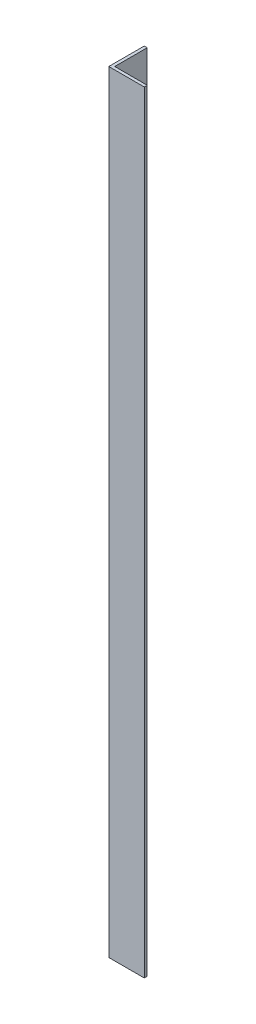
ISO-10303-21;
HEADER;
FILE_DESCRIPTION(('STEP AP214'),'2;1');
FILE_NAME('part.step','',(''),(''),'','','');
FILE_SCHEMA(('AUTOMOTIVE_DESIGN { 1 0 10303 214 1 1 1 1 }'));
ENDSEC;
DATA;
#1=APPLICATION_CONTEXT('core data for automotive mechanical design processes');
#2=APPLICATION_PROTOCOL_DEFINITION('international standard','automotive_design',2000,#1);
#3=PRODUCT_CONTEXT('',#1,'mechanical');
#4=PRODUCT('Part','Part','',(#3));
#5=PRODUCT_RELATED_PRODUCT_CATEGORY('part','',(#4));
#6=PRODUCT_DEFINITION_FORMATION('','',#4);
#7=PRODUCT_DEFINITION_CONTEXT('part definition',#1,'design');
#8=PRODUCT_DEFINITION('design','',#6,#7);
#9=PRODUCT_DEFINITION_SHAPE('','',#8);
#10=(LENGTH_UNIT() NAMED_UNIT(*) SI_UNIT(.MILLI.,.METRE.));
#11=(NAMED_UNIT(*) PLANE_ANGLE_UNIT() SI_UNIT($,.RADIAN.));
#12=(NAMED_UNIT(*) SI_UNIT($,.STERADIAN.) SOLID_ANGLE_UNIT());
#13=UNCERTAINTY_MEASURE_WITH_UNIT(LENGTH_MEASURE(1.E-05),#10,'distance_accuracy_value','');
#14=(GEOMETRIC_REPRESENTATION_CONTEXT(3) GLOBAL_UNCERTAINTY_ASSIGNED_CONTEXT((#13)) GLOBAL_UNIT_ASSIGNED_CONTEXT((#10,
#11,#12)) REPRESENTATION_CONTEXT('',''));
#15=CARTESIAN_POINT('',(0.,0.,0.));
#16=DIRECTION('',(0.,0.,1.));
#17=DIRECTION('',(1.,0.,0.));
#18=AXIS2_PLACEMENT_3D('',#15,#16,#17);
#19=CARTESIAN_POINT('',(0.,414.3375,0.));
#20=DIRECTION('',(1.,0.,0.));
#21=DIRECTION('',(0.,0.,-1.));
#22=AXIS2_PLACEMENT_3D('',#19,#20,#21);
#23=PLANE('',#22);
#24=DIRECTION('',(0.,0.,1.));
#25=VECTOR('',#24,1.);
#26=CARTESIAN_POINT('',(0.,0.,0.));
#27=LINE('',#26,#25);
#28=CARTESIAN_POINT('',(0.,0.,-19.05));
#29=VERTEX_POINT('',#28);
#30=CARTESIAN_POINT('',(0.,0.,0.));
#31=VERTEX_POINT('',#30);
#32=EDGE_CURVE('E123',#29,#31,#27,.T.);
#33=ORIENTED_EDGE('',*,*,#32,.T.);
#34=DIRECTION('',(0.,-1.,0.));
#35=VECTOR('',#34,1.);
#36=CARTESIAN_POINT('',(0.,414.3375,0.));
#37=LINE('',#36,#35);
#38=CARTESIAN_POINT('',(0.,414.3375,0.));
#39=VERTEX_POINT('',#38);
#40=EDGE_CURVE('E11',#39,#31,#37,.T.);
#41=ORIENTED_EDGE('',*,*,#40,.F.);
#42=DIRECTION('',(0.,0.,1.));
#43=VECTOR('',#42,1.);
#44=CARTESIAN_POINT('',(0.,414.3375,0.));
#45=LINE('',#44,#43);
#46=CARTESIAN_POINT('',(0.,414.3375,-19.05));
#47=VERTEX_POINT('',#46);
#48=EDGE_CURVE('E133',#47,#39,#45,.T.);
#49=ORIENTED_EDGE('',*,*,#48,.F.);
#50=DIRECTION('',(0.,-1.,0.));
#51=VECTOR('',#50,1.);
#52=CARTESIAN_POINT('',(0.,414.3375,-19.05));
#53=LINE('',#52,#51);
#54=EDGE_CURVE('E119',#47,#29,#53,.T.);
#55=ORIENTED_EDGE('',*,*,#54,.T.);
#56=EDGE_LOOP('',(#33,#41,#49,#55));
#57=FACE_BOUND('',#56,.T.);
#58=ADVANCED_FACE('F37',(#57),#23,.F.);
#59=CARTESIAN_POINT('',(0.,414.3375,0.));
#60=DIRECTION('',(0.,0.,-1.));
#61=DIRECTION('',(-1.,0.,0.));
#62=AXIS2_PLACEMENT_3D('',#59,#60,#61);
#63=PLANE('',#62);
#64=DIRECTION('',(1.,0.,0.));
#65=VECTOR('',#64,1.);
#66=CARTESIAN_POINT('',(0.,0.,0.));
#67=LINE('',#66,#65);
#68=CARTESIAN_POINT('',(19.05,0.,0.));
#69=VERTEX_POINT('',#68);
#70=EDGE_CURVE('E126',#31,#69,#67,.T.);
#71=ORIENTED_EDGE('',*,*,#70,.T.);
#72=DIRECTION('',(0.,-1.,0.));
#73=VECTOR('',#72,1.);
#74=CARTESIAN_POINT('',(19.05,414.3375,0.));
#75=LINE('',#74,#73);
#76=CARTESIAN_POINT('',(19.05,414.3375,0.));
#77=VERTEX_POINT('',#76);
#78=EDGE_CURVE('E46',#77,#69,#75,.T.);
#79=ORIENTED_EDGE('',*,*,#78,.F.);
#80=DIRECTION('',(1.,0.,0.));
#81=VECTOR('',#80,1.);
#82=CARTESIAN_POINT('',(0.,414.3375,0.));
#83=LINE('',#82,#81);
#84=EDGE_CURVE('E91',#39,#77,#83,.T.);
#85=ORIENTED_EDGE('',*,*,#84,.F.);
#86=ORIENTED_EDGE('',*,*,#40,.T.);
#87=EDGE_LOOP('',(#71,#79,#85,#86));
#88=FACE_BOUND('',#87,.T.);
#89=ADVANCED_FACE('F157',(#88),#63,.F.);
#90=CARTESIAN_POINT('',(19.05,414.3375,-1.5875));
#91=DIRECTION('',(-1.,0.,0.));
#92=DIRECTION('',(0.,0.,1.));
#93=AXIS2_PLACEMENT_3D('',#90,#91,#92);
#94=PLANE('',#93);
#95=DIRECTION('',(0.,0.,-1.));
#96=VECTOR('',#95,1.);
#97=CARTESIAN_POINT('',(19.05,0.,-1.5875));
#98=LINE('',#97,#96);
#99=CARTESIAN_POINT('',(19.05,0.,-1.5875));
#100=VERTEX_POINT('',#99);
#101=EDGE_CURVE('E128',#69,#100,#98,.T.);
#102=ORIENTED_EDGE('',*,*,#101,.T.);
#103=DIRECTION('',(0.,-1.,0.));
#104=VECTOR('',#103,1.);
#105=CARTESIAN_POINT('',(19.05,414.3375,-1.5875));
#106=LINE('',#105,#104);
#107=CARTESIAN_POINT('',(19.05,414.3375,-1.5875));
#108=VERTEX_POINT('',#107);
#109=EDGE_CURVE('E114',#108,#100,#106,.T.);
#110=ORIENTED_EDGE('',*,*,#109,.F.);
#111=DIRECTION('',(0.,0.,-1.));
#112=VECTOR('',#111,1.);
#113=CARTESIAN_POINT('',(19.05,414.3375,-1.5875));
#114=LINE('',#113,#112);
#115=EDGE_CURVE('E104',#77,#108,#114,.T.);
#116=ORIENTED_EDGE('',*,*,#115,.F.);
#117=ORIENTED_EDGE('',*,*,#78,.T.);
#118=EDGE_LOOP('',(#102,#110,#116,#117));
#119=FACE_BOUND('',#118,.T.);
#120=ADVANCED_FACE('F139',(#119),#94,.F.);
#121=CARTESIAN_POINT('',(1.5875,414.3375,-1.5875));
#122=DIRECTION('',(0.,0.,1.));
#123=DIRECTION('',(1.,0.,0.));
#124=AXIS2_PLACEMENT_3D('',#121,#122,#123);
#125=PLANE('',#124);
#126=DIRECTION('',(-1.,0.,0.));
#127=VECTOR('',#126,1.);
#128=CARTESIAN_POINT('',(1.5875,0.,-1.5875));
#129=LINE('',#128,#127);
#130=CARTESIAN_POINT('',(1.5875,0.,-1.5875));
#131=VERTEX_POINT('',#130);
#132=EDGE_CURVE('E112',#100,#131,#129,.T.);
#133=ORIENTED_EDGE('',*,*,#132,.T.);
#134=DIRECTION('',(0.,-1.,0.));
#135=VECTOR('',#134,1.);
#136=CARTESIAN_POINT('',(1.5875,414.3375,-1.5875));
#137=LINE('',#136,#135);
#138=CARTESIAN_POINT('',(1.5875,414.3375,-1.5875));
#139=VERTEX_POINT('',#138);
#140=EDGE_CURVE('E109',#139,#131,#137,.T.);
#141=ORIENTED_EDGE('',*,*,#140,.F.);
#142=DIRECTION('',(-1.,0.,0.));
#143=VECTOR('',#142,1.);
#144=CARTESIAN_POINT('',(1.5875,414.3375,-1.5875));
#145=LINE('',#144,#143);
#146=EDGE_CURVE('E98',#108,#139,#145,.T.);
#147=ORIENTED_EDGE('',*,*,#146,.F.);
#148=ORIENTED_EDGE('',*,*,#109,.T.);
#149=EDGE_LOOP('',(#133,#141,#147,#148));
#150=FACE_BOUND('',#149,.T.);
#151=ADVANCED_FACE('F110',(#150),#125,.F.);
#152=CARTESIAN_POINT('',(1.5875,414.3375,-1.5875));
#153=DIRECTION('',(-1.,0.,0.));
#154=DIRECTION('',(0.,0.,1.));
#155=AXIS2_PLACEMENT_3D('',#152,#153,#154);
#156=PLANE('',#155);
#157=DIRECTION('',(0.,0.,-1.));
#158=VECTOR('',#157,1.);
#159=CARTESIAN_POINT('',(1.5875,0.,-1.5875));
#160=LINE('',#159,#158);
#161=CARTESIAN_POINT('',(1.5875,0.,-19.05));
#162=VERTEX_POINT('',#161);
#163=EDGE_CURVE('E77',#131,#162,#160,.T.);
#164=ORIENTED_EDGE('',*,*,#163,.T.);
#165=DIRECTION('',(0.,-1.,0.));
#166=VECTOR('',#165,1.);
#167=CARTESIAN_POINT('',(1.5875,414.3375,-19.05));
#168=LINE('',#167,#166);
#169=CARTESIAN_POINT('',(1.5875,414.3375,-19.05));
#170=VERTEX_POINT('',#169);
#171=EDGE_CURVE('E115',#170,#162,#168,.T.);
#172=ORIENTED_EDGE('',*,*,#171,.F.);
#173=DIRECTION('',(0.,0.,-1.));
#174=VECTOR('',#173,1.);
#175=CARTESIAN_POINT('',(1.5875,414.3375,-1.5875));
#176=LINE('',#175,#174);
#177=EDGE_CURVE('E102',#139,#170,#176,.T.);
#178=ORIENTED_EDGE('',*,*,#177,.F.);
#179=ORIENTED_EDGE('',*,*,#140,.T.);
#180=EDGE_LOOP('',(#164,#172,#178,#179));
#181=FACE_BOUND('',#180,.T.);
#182=ADVANCED_FACE('F117',(#181),#156,.F.);
#183=CARTESIAN_POINT('',(0.,414.3375,-19.05));
#184=DIRECTION('',(0.,0.,1.));
#185=DIRECTION('',(1.,0.,0.));
#186=AXIS2_PLACEMENT_3D('',#183,#184,#185);
#187=PLANE('',#186);
#188=DIRECTION('',(-1.,0.,0.));
#189=VECTOR('',#188,1.);
#190=CARTESIAN_POINT('',(0.,0.,-19.05));
#191=LINE('',#190,#189);
#192=EDGE_CURVE('E83',#162,#29,#191,.T.);
#193=ORIENTED_EDGE('',*,*,#192,.T.);
#194=ORIENTED_EDGE('',*,*,#54,.F.);
#195=DIRECTION('',(-1.,0.,0.));
#196=VECTOR('',#195,1.);
#197=CARTESIAN_POINT('',(0.,414.3375,-19.05));
#198=LINE('',#197,#196);
#199=EDGE_CURVE('E54',#170,#47,#198,.T.);
#200=ORIENTED_EDGE('',*,*,#199,.F.);
#201=ORIENTED_EDGE('',*,*,#171,.T.);
#202=EDGE_LOOP('',(#193,#194,#200,#201));
#203=FACE_BOUND('',#202,.T.);
#204=ADVANCED_FACE('F146',(#203),#187,.F.);
#205=CARTESIAN_POINT('',(0.,414.3375,0.));
#206=DIRECTION('',(0.,-1.,0.));
#207=DIRECTION('',(0.,0.,-1.));
#208=AXIS2_PLACEMENT_3D('',#205,#206,#207);
#209=PLANE('',#208);
#210=ORIENTED_EDGE('',*,*,#48,.T.);
#211=ORIENTED_EDGE('',*,*,#84,.T.);
#212=ORIENTED_EDGE('',*,*,#115,.T.);
#213=ORIENTED_EDGE('',*,*,#146,.T.);
#214=ORIENTED_EDGE('',*,*,#177,.T.);
#215=ORIENTED_EDGE('',*,*,#199,.T.);
#216=EDGE_LOOP('',(#210,#211,#212,#213,#214,#215));
#217=FACE_BOUND('',#216,.T.);
#218=ADVANCED_FACE('F100',(#217),#209,.F.);
#219=CARTESIAN_POINT('',(0.,0.,0.));
#220=DIRECTION('',(0.,-1.,0.));
#221=DIRECTION('',(0.,0.,-1.));
#222=AXIS2_PLACEMENT_3D('',#219,#220,#221);
#223=PLANE('',#222);
#224=ORIENTED_EDGE('',*,*,#32,.F.);
#225=ORIENTED_EDGE('',*,*,#192,.F.);
#226=ORIENTED_EDGE('',*,*,#163,.F.);
#227=ORIENTED_EDGE('',*,*,#132,.F.);
#228=ORIENTED_EDGE('',*,*,#101,.F.);
#229=ORIENTED_EDGE('',*,*,#70,.F.);
#230=EDGE_LOOP('',(#224,#225,#226,#227,#228,#229));
#231=FACE_BOUND('',#230,.T.);
#232=ADVANCED_FACE('F142',(#231),#223,.T.);
#233=CLOSED_SHELL('',(#58,#89,#120,#151,#182,#204,#218,#232));
#234=MANIFOLD_SOLID_BREP('B2',#233);
#235=ADVANCED_BREP_SHAPE_REPRESENTATION('',(#18,#234),#14);
#236=SHAPE_DEFINITION_REPRESENTATION(#9,#235);
ENDSEC;
END-ISO-10303-21;
